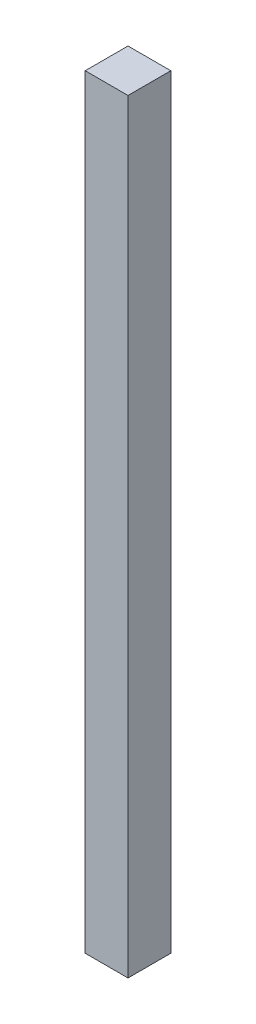
ISO-10303-21;
HEADER;
FILE_DESCRIPTION(('STEP AP214'),'2;1');
FILE_NAME('part.step','',(''),(''),'','','');
FILE_SCHEMA(('AUTOMOTIVE_DESIGN { 1 0 10303 214 1 1 1 1 }'));
ENDSEC;
DATA;
#1=APPLICATION_CONTEXT('core data for automotive mechanical design processes');
#2=APPLICATION_PROTOCOL_DEFINITION('international standard','automotive_design',2000,#1);
#3=PRODUCT_CONTEXT('',#1,'mechanical');
#4=PRODUCT('Part','Part','',(#3));
#5=PRODUCT_RELATED_PRODUCT_CATEGORY('part','',(#4));
#6=PRODUCT_DEFINITION_FORMATION('','',#4);
#7=PRODUCT_DEFINITION_CONTEXT('part definition',#1,'design');
#8=PRODUCT_DEFINITION('design','',#6,#7);
#9=PRODUCT_DEFINITION_SHAPE('','',#8);
#10=(LENGTH_UNIT() NAMED_UNIT(*) SI_UNIT(.MILLI.,.METRE.));
#11=(NAMED_UNIT(*) PLANE_ANGLE_UNIT() SI_UNIT($,.RADIAN.));
#12=(NAMED_UNIT(*) SI_UNIT($,.STERADIAN.) SOLID_ANGLE_UNIT());
#13=UNCERTAINTY_MEASURE_WITH_UNIT(LENGTH_MEASURE(1.E-05),#10,'distance_accuracy_value','');
#14=(GEOMETRIC_REPRESENTATION_CONTEXT(3) GLOBAL_UNCERTAINTY_ASSIGNED_CONTEXT((#13)) GLOBAL_UNIT_ASSIGNED_CONTEXT((#10,
#11,#12)) REPRESENTATION_CONTEXT('',''));
#15=CARTESIAN_POINT('',(0.,0.,0.));
#16=DIRECTION('',(0.,0.,1.));
#17=DIRECTION('',(1.,0.,0.));
#18=AXIS2_PLACEMENT_3D('',#15,#16,#17);
#19=CARTESIAN_POINT('',(0.,453.39,0.));
#20=DIRECTION('',(1.,0.,0.));
#21=DIRECTION('',(0.,0.,-1.));
#22=AXIS2_PLACEMENT_3D('',#19,#20,#21);
#23=PLANE('',#22);
#24=DIRECTION('',(0.,0.,1.));
#25=VECTOR('',#24,1.);
#26=CARTESIAN_POINT('',(0.,0.,0.));
#27=LINE('',#26,#25);
#28=CARTESIAN_POINT('',(0.,0.,-25.3999999999999));
#29=VERTEX_POINT('',#28);
#30=CARTESIAN_POINT('',(0.,0.,0.));
#31=VERTEX_POINT('',#30);
#32=EDGE_CURVE('E97',#29,#31,#27,.T.);
#33=ORIENTED_EDGE('',*,*,#32,.T.);
#34=DIRECTION('',(0.,-1.,0.));
#35=VECTOR('',#34,1.);
#36=CARTESIAN_POINT('',(0.,453.39,0.));
#37=LINE('',#36,#35);
#38=CARTESIAN_POINT('',(0.,453.39,0.));
#39=VERTEX_POINT('',#38);
#40=EDGE_CURVE('E11',#39,#31,#37,.T.);
#41=ORIENTED_EDGE('',*,*,#40,.F.);
#42=DIRECTION('',(0.,0.,1.));
#43=VECTOR('',#42,1.);
#44=CARTESIAN_POINT('',(0.,453.39,0.));
#45=LINE('',#44,#43);
#46=CARTESIAN_POINT('',(0.,453.390000000002,-25.4000000000003));
#47=VERTEX_POINT('',#46);
#48=EDGE_CURVE('E85',#47,#39,#45,.T.);
#49=ORIENTED_EDGE('',*,*,#48,.F.);
#50=DIRECTION('',(0.,-1.,0.));
#51=VECTOR('',#50,1.);
#52=CARTESIAN_POINT('',(0.,453.390000000002,-25.4000000000003));
#53=LINE('',#52,#51);
#54=EDGE_CURVE('E93',#47,#29,#53,.T.);
#55=ORIENTED_EDGE('',*,*,#54,.T.);
#56=EDGE_LOOP('',(#33,#41,#49,#55));
#57=FACE_BOUND('',#56,.T.);
#58=ADVANCED_FACE('F34',(#57),#23,.F.);
#59=CARTESIAN_POINT('',(0.,453.39,0.));
#60=DIRECTION('',(0.,0.,-1.));
#61=DIRECTION('',(-1.,0.,0.));
#62=AXIS2_PLACEMENT_3D('',#59,#60,#61);
#63=PLANE('',#62);
#64=DIRECTION('',(1.,0.,0.));
#65=VECTOR('',#64,1.);
#66=CARTESIAN_POINT('',(0.,0.,0.));
#67=LINE('',#66,#65);
#68=CARTESIAN_POINT('',(25.4,0.,0.));
#69=VERTEX_POINT('',#68);
#70=EDGE_CURVE('E89',#31,#69,#67,.T.);
#71=ORIENTED_EDGE('',*,*,#70,.T.);
#72=DIRECTION('',(0.,-1.,0.));
#73=VECTOR('',#72,1.);
#74=CARTESIAN_POINT('',(25.4,453.39,0.));
#75=LINE('',#74,#73);
#76=CARTESIAN_POINT('',(25.4,453.39,0.));
#77=VERTEX_POINT('',#76);
#78=EDGE_CURVE('E42',#77,#69,#75,.T.);
#79=ORIENTED_EDGE('',*,*,#78,.F.);
#80=DIRECTION('',(1.,0.,0.));
#81=VECTOR('',#80,1.);
#82=CARTESIAN_POINT('',(0.,453.39,0.));
#83=LINE('',#82,#81);
#84=EDGE_CURVE('E80',#39,#77,#83,.T.);
#85=ORIENTED_EDGE('',*,*,#84,.F.);
#86=ORIENTED_EDGE('',*,*,#40,.T.);
#87=EDGE_LOOP('',(#71,#79,#85,#86));
#88=FACE_BOUND('',#87,.T.);
#89=ADVANCED_FACE('F88',(#88),#63,.F.);
#90=CARTESIAN_POINT('',(25.4,453.39,0.));
#91=DIRECTION('',(-1.,0.,0.));
#92=DIRECTION('',(0.,0.,1.));
#93=AXIS2_PLACEMENT_3D('',#90,#91,#92);
#94=PLANE('',#93);
#95=DIRECTION('',(0.,0.,-1.));
#96=VECTOR('',#95,1.);
#97=CARTESIAN_POINT('',(25.4,0.,0.));
#98=LINE('',#97,#96);
#99=CARTESIAN_POINT('',(25.4,0.,-25.3999999999999));
#100=VERTEX_POINT('',#99);
#101=EDGE_CURVE('E67',#69,#100,#98,.T.);
#102=ORIENTED_EDGE('',*,*,#101,.T.);
#103=DIRECTION('',(0.,-1.,0.));
#104=VECTOR('',#103,1.);
#105=CARTESIAN_POINT('',(25.4,453.390000000002,-25.4000000000003));
#106=LINE('',#105,#104);
#107=CARTESIAN_POINT('',(25.4,453.390000000002,-25.4000000000003));
#108=VERTEX_POINT('',#107);
#109=EDGE_CURVE('E90',#108,#100,#106,.T.);
#110=ORIENTED_EDGE('',*,*,#109,.F.);
#111=DIRECTION('',(0.,0.,-1.));
#112=VECTOR('',#111,1.);
#113=CARTESIAN_POINT('',(25.4,453.39,0.));
#114=LINE('',#113,#112);
#115=EDGE_CURVE('E83',#77,#108,#114,.T.);
#116=ORIENTED_EDGE('',*,*,#115,.F.);
#117=ORIENTED_EDGE('',*,*,#78,.T.);
#118=EDGE_LOOP('',(#102,#110,#116,#117));
#119=FACE_BOUND('',#118,.T.);
#120=ADVANCED_FACE('F91',(#119),#94,.F.);
#121=CARTESIAN_POINT('',(0.,453.390000000002,-25.4000000000003));
#122=DIRECTION('',(0.,0.,1.));
#123=DIRECTION('',(1.,0.,0.));
#124=AXIS2_PLACEMENT_3D('',#121,#122,#123);
#125=PLANE('',#124);
#126=DIRECTION('',(-1.,0.,0.));
#127=VECTOR('',#126,1.);
#128=CARTESIAN_POINT('',(0.,0.,-25.3999999999999));
#129=LINE('',#128,#127);
#130=EDGE_CURVE('E73',#100,#29,#129,.T.);
#131=ORIENTED_EDGE('',*,*,#130,.T.);
#132=ORIENTED_EDGE('',*,*,#54,.F.);
#133=DIRECTION('',(-1.,0.,0.));
#134=VECTOR('',#133,1.);
#135=CARTESIAN_POINT('',(0.,453.390000000002,-25.4000000000003));
#136=LINE('',#135,#134);
#137=EDGE_CURVE('E50',#108,#47,#136,.T.);
#138=ORIENTED_EDGE('',*,*,#137,.F.);
#139=ORIENTED_EDGE('',*,*,#109,.T.);
#140=EDGE_LOOP('',(#131,#132,#138,#139));
#141=FACE_BOUND('',#140,.T.);
#142=ADVANCED_FACE('F104',(#141),#125,.F.);
#143=CARTESIAN_POINT('',(0.,453.39,0.));
#144=DIRECTION('',(0.,-1.,0.));
#145=DIRECTION('',(0.,0.,-1.));
#146=AXIS2_PLACEMENT_3D('',#143,#144,#145);
#147=PLANE('',#146);
#148=ORIENTED_EDGE('',*,*,#48,.T.);
#149=ORIENTED_EDGE('',*,*,#84,.T.);
#150=ORIENTED_EDGE('',*,*,#115,.T.);
#151=ORIENTED_EDGE('',*,*,#137,.T.);
#152=EDGE_LOOP('',(#148,#149,#150,#151));
#153=FACE_BOUND('',#152,.T.);
#154=ADVANCED_FACE('F81',(#153),#147,.F.);
#155=CARTESIAN_POINT('',(0.,0.,0.));
#156=DIRECTION('',(0.,-1.,0.));
#157=DIRECTION('',(0.,0.,-1.));
#158=AXIS2_PLACEMENT_3D('',#155,#156,#157);
#159=PLANE('',#158);
#160=ORIENTED_EDGE('',*,*,#32,.F.);
#161=ORIENTED_EDGE('',*,*,#130,.F.);
#162=ORIENTED_EDGE('',*,*,#101,.F.);
#163=ORIENTED_EDGE('',*,*,#70,.F.);
#164=EDGE_LOOP('',(#160,#161,#162,#163));
#165=FACE_BOUND('',#164,.T.);
#166=ADVANCED_FACE('F107',(#165),#159,.T.);
#167=CLOSED_SHELL('',(#58,#89,#120,#142,#154,#166));
#168=MANIFOLD_SOLID_BREP('B2',#167);
#169=ADVANCED_BREP_SHAPE_REPRESENTATION('',(#18,#168),#14);
#170=SHAPE_DEFINITION_REPRESENTATION(#9,#169);
ENDSEC;
END-ISO-10303-21;
